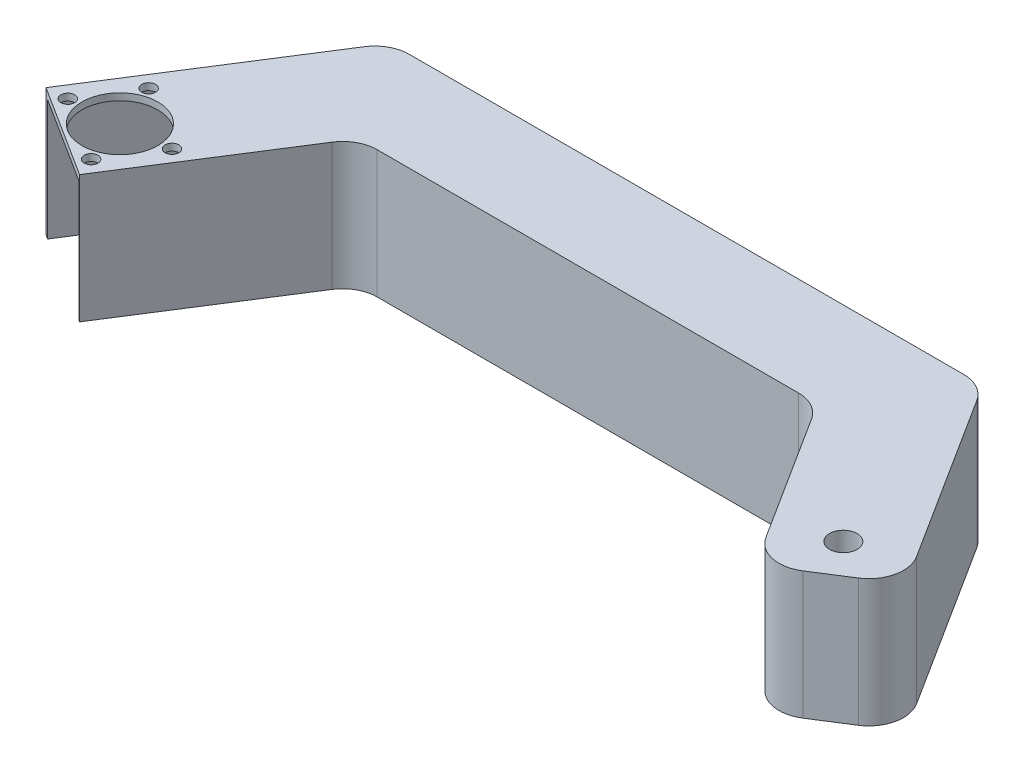
ISO-10303-21;
HEADER;
FILE_DESCRIPTION(('STEP AP214'),'2;1');
FILE_NAME('part.step','',(''),(''),'','','');
FILE_SCHEMA(('AUTOMOTIVE_DESIGN { 1 0 10303 214 1 1 1 1 }'));
ENDSEC;
DATA;
#1=APPLICATION_CONTEXT('core data for automotive mechanical design processes');
#2=APPLICATION_PROTOCOL_DEFINITION('international standard','automotive_design',2000,#1);
#3=PRODUCT_CONTEXT('',#1,'mechanical');
#4=PRODUCT('Part','Part','',(#3));
#5=PRODUCT_RELATED_PRODUCT_CATEGORY('part','',(#4));
#6=PRODUCT_DEFINITION_FORMATION('','',#4);
#7=PRODUCT_DEFINITION_CONTEXT('part definition',#1,'design');
#8=PRODUCT_DEFINITION('design','',#6,#7);
#9=PRODUCT_DEFINITION_SHAPE('','',#8);
#10=(LENGTH_UNIT() NAMED_UNIT(*) SI_UNIT(.MILLI.,.METRE.));
#11=(NAMED_UNIT(*) PLANE_ANGLE_UNIT() SI_UNIT($,.RADIAN.));
#12=(NAMED_UNIT(*) SI_UNIT($,.STERADIAN.) SOLID_ANGLE_UNIT());
#13=UNCERTAINTY_MEASURE_WITH_UNIT(LENGTH_MEASURE(1.E-05),#10,'distance_accuracy_value','');
#14=(GEOMETRIC_REPRESENTATION_CONTEXT(3) GLOBAL_UNCERTAINTY_ASSIGNED_CONTEXT((#13)) GLOBAL_UNIT_ASSIGNED_CONTEXT((#10,
#11,#12)) REPRESENTATION_CONTEXT('',''));
#15=CARTESIAN_POINT('',(0.,0.,0.));
#16=DIRECTION('',(0.,0.,1.));
#17=DIRECTION('',(1.,0.,0.));
#18=AXIS2_PLACEMENT_3D('',#15,#16,#17);
#19=CARTESIAN_POINT('',(45.3447070196285,-55.,18.3099547674291));
#20=DIRECTION('',(0.,1.,0.));
#21=DIRECTION('',(0.,0.,1.));
#22=AXIS2_PLACEMENT_3D('',#19,#20,#21);
#23=CYLINDRICAL_SURFACE('',#22,11.);
#24=CARTESIAN_POINT('',(45.3447070196285,37.,18.3099547674291));
#25=DIRECTION('',(0.,1.,0.));
#26=DIRECTION('',(0.,0.,1.));
#27=AXIS2_PLACEMENT_3D('',#24,#25,#26);
#28=CIRCLE('',#27,11.);
#29=CARTESIAN_POINT('',(45.3447070196285,37.,29.3099547674291));
#30=VERTEX_POINT('',#29);
#31=EDGE_CURVE('E243',#30,#30,#28,.T.);
#32=ORIENTED_EDGE('',*,*,#31,.T.);
#33=EDGE_LOOP('',(#32));
#34=FACE_BOUND('',#33,.T.);
#35=CARTESIAN_POINT('',(45.3447070196285,35.,18.3099547674291));
#36=DIRECTION('',(0.,-1.,0.));
#37=DIRECTION('',(0.,0.,-1.));
#38=AXIS2_PLACEMENT_3D('',#35,#36,#37);
#39=CIRCLE('',#38,11.);
#40=CARTESIAN_POINT('',(45.3447070196285,35.,7.30995476742916));
#41=VERTEX_POINT('',#40);
#42=EDGE_CURVE('E388',#41,#41,#39,.F.);
#43=ORIENTED_EDGE('',*,*,#42,.F.);
#44=EDGE_LOOP('',(#43));
#45=FACE_BOUND('',#44,.T.);
#46=ADVANCED_FACE('F37',(#34,#45),#23,.F.);
#47=CARTESIAN_POINT('',(59.1877599111612,-55.,17.0372070932107));
#48=DIRECTION('',(0.,1.,0.));
#49=DIRECTION('',(0.,0.,1.));
#50=AXIS2_PLACEMENT_3D('',#47,#48,#49);
#51=CYLINDRICAL_SURFACE('',#50,2.);
#52=CARTESIAN_POINT('',(59.1877599111612,37.,17.0372070932107));
#53=DIRECTION('',(0.,1.,0.));
#54=DIRECTION('',(0.,0.,-1.));
#55=AXIS2_PLACEMENT_3D('',#52,#53,#54);
#56=CIRCLE('',#55,2.);
#57=CARTESIAN_POINT('',(59.1877599111612,37.,15.0372070932107));
#58=VERTEX_POINT('',#57);
#59=EDGE_CURVE('E398',#58,#58,#56,.T.);
#60=ORIENTED_EDGE('',*,*,#59,.T.);
#61=EDGE_LOOP('',(#60));
#62=FACE_BOUND('',#61,.T.);
#63=CARTESIAN_POINT('',(59.1877599111612,35.,17.0372070932107));
#64=DIRECTION('',(0.,-1.,0.));
#65=DIRECTION('',(0.,0.,-1.));
#66=AXIS2_PLACEMENT_3D('',#63,#64,#65);
#67=CIRCLE('',#66,2.);
#68=CARTESIAN_POINT('',(59.1877599111612,35.,15.0372070932107));
#69=VERTEX_POINT('',#68);
#70=EDGE_CURVE('E385',#69,#69,#67,.F.);
#71=ORIENTED_EDGE('',*,*,#70,.F.);
#72=EDGE_LOOP('',(#71));
#73=FACE_BOUND('',#72,.T.);
#74=ADVANCED_FACE('F415',(#62,#73),#51,.F.);
#75=CARTESIAN_POINT('',(40.6210193428313,-55.,5.23567563884718));
#76=DIRECTION('',(0.,1.,0.));
#77=DIRECTION('',(0.,0.,1.));
#78=AXIS2_PLACEMENT_3D('',#75,#76,#77);
#79=CYLINDRICAL_SURFACE('',#78,2.);
#80=CARTESIAN_POINT('',(40.6210193428313,37.,5.23567563884718));
#81=DIRECTION('',(0.,1.,0.));
#82=DIRECTION('',(0.,0.,-1.));
#83=AXIS2_PLACEMENT_3D('',#80,#81,#82);
#84=CIRCLE('',#83,2.);
#85=CARTESIAN_POINT('',(40.6210193428313,37.,3.23567563884718));
#86=VERTEX_POINT('',#85);
#87=EDGE_CURVE('E395',#86,#86,#84,.T.);
#88=ORIENTED_EDGE('',*,*,#87,.T.);
#89=EDGE_LOOP('',(#88));
#90=FACE_BOUND('',#89,.T.);
#91=CARTESIAN_POINT('',(40.6210193428313,35.,5.23567563884718));
#92=DIRECTION('',(0.,-1.,0.));
#93=DIRECTION('',(0.,0.,-1.));
#94=AXIS2_PLACEMENT_3D('',#91,#92,#93);
#95=CIRCLE('',#94,2.);
#96=CARTESIAN_POINT('',(40.6210193428313,35.,3.23567563884718));
#97=VERTEX_POINT('',#96);
#98=EDGE_CURVE('E382',#97,#97,#95,.F.);
#99=ORIENTED_EDGE('',*,*,#98,.F.);
#100=EDGE_LOOP('',(#99));
#101=FACE_BOUND('',#100,.T.);
#102=ADVANCED_FACE('F418',(#90,#101),#79,.F.);
#103=CARTESIAN_POINT('',(50.0683946964257,-55.,31.3842338960111));
#104=DIRECTION('',(0.,1.,0.));
#105=DIRECTION('',(0.,0.,1.));
#106=AXIS2_PLACEMENT_3D('',#103,#104,#105);
#107=CYLINDRICAL_SURFACE('',#106,2.);
#108=CARTESIAN_POINT('',(50.0683946964257,37.,31.3842338960111));
#109=DIRECTION('',(0.,1.,0.));
#110=DIRECTION('',(0.,0.,1.));
#111=AXIS2_PLACEMENT_3D('',#108,#109,#110);
#112=CIRCLE('',#111,2.);
#113=CARTESIAN_POINT('',(50.0683946964257,37.,33.3842338960111));
#114=VERTEX_POINT('',#113);
#115=EDGE_CURVE('E247',#114,#114,#112,.T.);
#116=ORIENTED_EDGE('',*,*,#115,.T.);
#117=EDGE_LOOP('',(#116));
#118=FACE_BOUND('',#117,.T.);
#119=CARTESIAN_POINT('',(50.0683946964257,35.,31.3842338960111));
#120=DIRECTION('',(0.,-1.,0.));
#121=DIRECTION('',(0.,0.,-1.));
#122=AXIS2_PLACEMENT_3D('',#119,#120,#121);
#123=CIRCLE('',#122,2.);
#124=CARTESIAN_POINT('',(50.0683946964257,35.,29.3842338960111));
#125=VERTEX_POINT('',#124);
#126=EDGE_CURVE('E379',#125,#125,#123,.F.);
#127=ORIENTED_EDGE('',*,*,#126,.F.);
#128=EDGE_LOOP('',(#127));
#129=FACE_BOUND('',#128,.T.);
#130=ADVANCED_FACE('F435',(#118,#129),#107,.F.);
#131=CARTESIAN_POINT('',(31.5016541280958,-55.,19.5827024416476));
#132=DIRECTION('',(0.,1.,0.));
#133=DIRECTION('',(0.,0.,1.));
#134=AXIS2_PLACEMENT_3D('',#131,#132,#133);
#135=CYLINDRICAL_SURFACE('',#134,2.);
#136=CARTESIAN_POINT('',(31.5016541280958,37.,19.5827024416476));
#137=DIRECTION('',(0.,1.,0.));
#138=DIRECTION('',(0.,0.,1.));
#139=AXIS2_PLACEMENT_3D('',#136,#137,#138);
#140=CIRCLE('',#139,2.);
#141=CARTESIAN_POINT('',(31.5016541280958,37.,21.5827024416476));
#142=VERTEX_POINT('',#141);
#143=EDGE_CURVE('E256',#142,#142,#140,.T.);
#144=ORIENTED_EDGE('',*,*,#143,.T.);
#145=EDGE_LOOP('',(#144));
#146=FACE_BOUND('',#145,.T.);
#147=CARTESIAN_POINT('',(31.5016541280958,35.,19.5827024416476));
#148=DIRECTION('',(0.,-1.,0.));
#149=DIRECTION('',(0.,0.,-1.));
#150=AXIS2_PLACEMENT_3D('',#147,#148,#149);
#151=CIRCLE('',#150,2.);
#152=CARTESIAN_POINT('',(31.5016541280958,35.,17.5827024416476));
#153=VERTEX_POINT('',#152);
#154=EDGE_CURVE('E41',#153,#153,#151,.F.);
#155=ORIENTED_EDGE('',*,*,#154,.F.);
#156=EDGE_LOOP('',(#155));
#157=FACE_BOUND('',#156,.T.);
#158=ADVANCED_FACE('F433',(#146,#157),#135,.F.);
#159=CARTESIAN_POINT('',(69.8496368900044,37.,-31.1073872598005));
#160=DIRECTION('',(0.,-1.,0.));
#161=DIRECTION('',(0.,0.,-1.));
#162=AXIS2_PLACEMENT_3D('',#159,#160,#161);
#163=CYLINDRICAL_SURFACE('',#162,10.);
#164=CARTESIAN_POINT('',(69.8496368900044,0.,-31.1073872598005));
#165=DIRECTION('',(0.,1.,0.));
#166=DIRECTION('',(0.,0.,1.));
#167=AXIS2_PLACEMENT_3D('',#164,#165,#166);
#168=CIRCLE('',#167,10.);
#169=CARTESIAN_POINT('',(69.8496368900044,0.,-41.1073872598005));
#170=VERTEX_POINT('',#169);
#171=CARTESIAN_POINT('',(61.4102093589454,0.,-36.4717197390567));
#172=VERTEX_POINT('',#171);
#173=EDGE_CURVE('E183',#170,#172,#168,.T.);
#174=ORIENTED_EDGE('',*,*,#173,.T.);
#175=DIRECTION('',(0.,-1.,0.));
#176=VECTOR('',#175,1.);
#177=CARTESIAN_POINT('',(61.4102093589454,37.,-36.4717197390567));
#178=LINE('',#177,#176);
#179=CARTESIAN_POINT('',(61.4102093589454,37.,-36.4717197390567));
#180=VERTEX_POINT('',#179);
#181=EDGE_CURVE('E11',#180,#172,#178,.T.);
#182=ORIENTED_EDGE('',*,*,#181,.F.);
#183=CARTESIAN_POINT('',(69.8496368900044,37.,-31.1073872598005));
#184=DIRECTION('',(0.,1.,0.));
#185=DIRECTION('',(0.,0.,1.));
#186=AXIS2_PLACEMENT_3D('',#183,#184,#185);
#187=CIRCLE('',#186,10.);
#188=CARTESIAN_POINT('',(69.8496368900044,37.,-41.1073872598005));
#189=VERTEX_POINT('',#188);
#190=EDGE_CURVE('E213',#189,#180,#187,.T.);
#191=ORIENTED_EDGE('',*,*,#190,.F.);
#192=DIRECTION('',(0.,-1.,0.));
#193=VECTOR('',#192,1.);
#194=CARTESIAN_POINT('',(69.8496368900044,37.,-41.1073872598005));
#195=LINE('',#194,#193);
#196=EDGE_CURVE('E179',#189,#170,#195,.T.);
#197=ORIENTED_EDGE('',*,*,#196,.T.);
#198=EDGE_LOOP('',(#174,#182,#191,#197));
#199=FACE_BOUND('',#198,.T.);
#200=ADVANCED_FACE('F39',(#199),#163,.T.);
#201=CARTESIAN_POINT('',(25.5492890402526,37.,19.9464160489504));
#202=DIRECTION('',(0.843942753105905,0.,0.536433247925616));
#203=DIRECTION('',(0.536433247925616,0.,-0.843942753105905));
#204=AXIS2_PLACEMENT_3D('',#201,#202,#203);
#205=PLANE('',#204);
#206=DIRECTION('',(-0.536433247925616,0.,0.843942753105905));
#207=VECTOR('',#206,1.);
#208=CARTESIAN_POINT('',(25.5492890402526,0.,19.9464160489504));
#209=LINE('',#208,#207);
#210=CARTESIAN_POINT('',(25.5492890402526,0.,19.9464160489504));
#211=VERTEX_POINT('',#210);
#212=EDGE_CURVE('E186',#172,#211,#209,.T.);
#213=ORIENTED_EDGE('',*,*,#212,.T.);
#214=DIRECTION('',(0.,-1.,0.));
#215=VECTOR('',#214,1.);
#216=CARTESIAN_POINT('',(25.5492890402526,37.,19.9464160489504));
#217=LINE('',#216,#215);
#218=CARTESIAN_POINT('',(25.5492890402526,37.,19.9464160489504));
#219=VERTEX_POINT('',#218);
#220=EDGE_CURVE('E46',#219,#211,#217,.T.);
#221=ORIENTED_EDGE('',*,*,#220,.F.);
#222=DIRECTION('',(-0.536433247925616,0.,0.843942753105905));
#223=VECTOR('',#222,1.);
#224=CARTESIAN_POINT('',(30.9136215195088,37.,11.5069885178913));
#225=LINE('',#224,#223);
#226=EDGE_CURVE('E122',#180,#219,#225,.T.);
#227=ORIENTED_EDGE('',*,*,#226,.F.);
#228=ORIENTED_EDGE('',*,*,#181,.T.);
#229=EDGE_LOOP('',(#213,#221,#227,#228));
#230=FACE_BOUND('',#229,.T.);
#231=ADVANCED_FACE('F295',(#230),#205,.F.);
#232=CARTESIAN_POINT('',(52.2657270487895,37.,36.9281195604496));
#233=DIRECTION('',(0.536433247925616,0.,-0.843942753105905));
#234=DIRECTION('',(-0.843942753105905,0.,-0.536433247925616));
#235=AXIS2_PLACEMENT_3D('',#232,#233,#234);
#236=PLANE('',#235);
#237=DIRECTION('',(-0.843942753105905,0.,-0.536433247925616));
#238=VECTOR('',#237,1.);
#239=CARTESIAN_POINT('',(52.2657270487895,35.,36.9281195604496));
#240=LINE('',#239,#238);
#241=CARTESIAN_POINT('',(51.749431594295,35.,36.5999479557709));
#242=VERTEX_POINT('',#241);
#243=CARTESIAN_POINT('',(26.8140358286757,35.,20.750323926612));
#244=VERTEX_POINT('',#243);
#245=EDGE_CURVE('E359',#242,#244,#240,.T.);
#246=ORIENTED_EDGE('',*,*,#245,.F.);
#247=DIRECTION('',(0.,-1.,0.));
#248=VECTOR('',#247,1.);
#249=CARTESIAN_POINT('',(51.749431594295,37.,36.5999479557709));
#250=LINE('',#249,#248);
#251=CARTESIAN_POINT('',(51.749431594295,0.,36.5999479557709));
#252=VERTEX_POINT('',#251);
#253=EDGE_CURVE('E393',#242,#252,#250,.T.);
#254=ORIENTED_EDGE('',*,*,#253,.T.);
#255=DIRECTION('',(0.843942753105905,0.,0.536433247925616));
#256=VECTOR('',#255,1.);
#257=CARTESIAN_POINT('',(52.2657270487895,0.,36.9281195604496));
#258=LINE('',#257,#256);
#259=CARTESIAN_POINT('',(52.2657270487895,0.,36.9281195604496));
#260=VERTEX_POINT('',#259);
#261=EDGE_CURVE('E189',#252,#260,#258,.T.);
#262=ORIENTED_EDGE('',*,*,#261,.T.);
#263=DIRECTION('',(0.,-1.,0.));
#264=VECTOR('',#263,1.);
#265=CARTESIAN_POINT('',(52.2657270487895,37.,36.9281195604496));
#266=LINE('',#265,#264);
#267=CARTESIAN_POINT('',(52.2657270487895,37.,36.9281195604496));
#268=VERTEX_POINT('',#267);
#269=EDGE_CURVE('E238',#268,#260,#266,.T.);
#270=ORIENTED_EDGE('',*,*,#269,.F.);
#271=DIRECTION('',(0.843942753105905,0.,0.536433247925616));
#272=VECTOR('',#271,1.);
#273=CARTESIAN_POINT('',(52.2657270487895,37.,36.9281195604496));
#274=LINE('',#273,#272);
#275=EDGE_CURVE('E260',#219,#268,#274,.T.);
#276=ORIENTED_EDGE('',*,*,#275,.F.);
#277=ORIENTED_EDGE('',*,*,#220,.T.);
#278=CARTESIAN_POINT('',(26.8140358286757,0.,20.750323926612));
#279=VERTEX_POINT('',#278);
#280=EDGE_CURVE('E190',#211,#279,#258,.T.);
#281=ORIENTED_EDGE('',*,*,#280,.T.);
#282=DIRECTION('',(0.,1.,0.));
#283=VECTOR('',#282,1.);
#284=CARTESIAN_POINT('',(26.8140358286757,37.,20.750323926612));
#285=LINE('',#284,#283);
#286=EDGE_CURVE('E54',#279,#244,#285,.T.);
#287=ORIENTED_EDGE('',*,*,#286,.T.);
#288=EDGE_LOOP('',(#246,#254,#262,#270,#276,#277,#281,#287));
#289=FACE_BOUND('',#288,.T.);
#290=ADVANCED_FACE('F299',(#289),#236,.F.);
#291=CARTESIAN_POINT('',(80.7313683807615,37.,-7.85540533762101));
#292=DIRECTION('',(-0.843942753105905,0.,-0.536433247925616));
#293=DIRECTION('',(-0.536433247925616,0.,0.843942753105905));
#294=AXIS2_PLACEMENT_3D('',#291,#292,#293);
#295=PLANE('',#294);
#296=DIRECTION('',(0.536433247925616,0.,-0.843942753105905));
#297=VECTOR('',#296,1.);
#298=CARTESIAN_POINT('',(80.7313683807615,0.,-7.85540533762101));
#299=LINE('',#298,#297);
#300=CARTESIAN_POINT('',(80.7313683807615,0.,-7.85540533762101));
#301=VERTEX_POINT('',#300);
#302=EDGE_CURVE('E193',#260,#301,#299,.T.);
#303=ORIENTED_EDGE('',*,*,#302,.T.);
#304=DIRECTION('',(0.,-1.,0.));
#305=VECTOR('',#304,1.);
#306=CARTESIAN_POINT('',(80.7313683807615,37.,-7.85540533762101));
#307=LINE('',#306,#305);
#308=CARTESIAN_POINT('',(80.7313683807615,37.,-7.85540533762101));
#309=VERTEX_POINT('',#308);
#310=EDGE_CURVE('E235',#309,#301,#307,.T.);
#311=ORIENTED_EDGE('',*,*,#310,.F.);
#312=DIRECTION('',(0.536433247925616,0.,-0.843942753105905));
#313=VECTOR('',#312,1.);
#314=CARTESIAN_POINT('',(57.6300595280457,37.,28.4886920293905));
#315=LINE('',#314,#313);
#316=EDGE_CURVE('E262',#268,#309,#315,.T.);
#317=ORIENTED_EDGE('',*,*,#316,.F.);
#318=ORIENTED_EDGE('',*,*,#269,.T.);
#319=EDGE_LOOP('',(#303,#311,#317,#318));
#320=FACE_BOUND('',#319,.T.);
#321=ADVANCED_FACE('F305',(#320),#295,.F.);
#322=CARTESIAN_POINT('',(89.1707959118206,37.,-2.49107285836488));
#323=DIRECTION('',(0.,-1.,0.));
#324=DIRECTION('',(0.,0.,-1.));
#325=AXIS2_PLACEMENT_3D('',#322,#323,#324);
#326=CYLINDRICAL_SURFACE('',#325,10.);
#327=CARTESIAN_POINT('',(89.1707959118206,0.,-2.49107285836488));
#328=DIRECTION('',(0.,-1.,0.));
#329=DIRECTION('',(0.,0.,1.));
#330=AXIS2_PLACEMENT_3D('',#327,#328,#329);
#331=CIRCLE('',#330,10.);
#332=CARTESIAN_POINT('',(89.1707959118207,0.,-12.4910728583649));
#333=VERTEX_POINT('',#332);
#334=EDGE_CURVE('E195',#301,#333,#331,.T.);
#335=ORIENTED_EDGE('',*,*,#334,.T.);
#336=DIRECTION('',(0.,-1.,0.));
#337=VECTOR('',#336,1.);
#338=CARTESIAN_POINT('',(89.1707959118207,37.,-12.4910728583649));
#339=LINE('',#338,#337);
#340=CARTESIAN_POINT('',(89.1707959118207,37.,-12.4910728583649));
#341=VERTEX_POINT('',#340);
#342=EDGE_CURVE('E232',#341,#333,#339,.T.);
#343=ORIENTED_EDGE('',*,*,#342,.F.);
#344=CARTESIAN_POINT('',(89.1707959118206,37.,-2.49107285836488));
#345=DIRECTION('',(0.,-1.,0.));
#346=DIRECTION('',(0.,0.,1.));
#347=AXIS2_PLACEMENT_3D('',#344,#345,#346);
#348=CIRCLE('',#347,10.);
#349=EDGE_CURVE('E264',#309,#341,#348,.T.);
#350=ORIENTED_EDGE('',*,*,#349,.F.);
#351=ORIENTED_EDGE('',*,*,#310,.T.);
#352=EDGE_LOOP('',(#335,#343,#350,#351));
#353=FACE_BOUND('',#352,.T.);
#354=ADVANCED_FACE('F311',(#353),#326,.F.);
#355=CARTESIAN_POINT('',(89.1707959118207,37.,-12.4910728583649));
#356=DIRECTION('',(0.,0.,-1.));
#357=DIRECTION('',(-1.,0.,0.));
#358=AXIS2_PLACEMENT_3D('',#355,#356,#357);
#359=PLANE('',#358);
#360=DIRECTION('',(1.,0.,0.));
#361=VECTOR('',#360,1.);
#362=CARTESIAN_POINT('',(89.1707959118207,0.,-12.4910728583649));
#363=LINE('',#362,#361);
#364=CARTESIAN_POINT('',(211.363090572033,0.,-12.4910728583649));
#365=VERTEX_POINT('',#364);
#366=EDGE_CURVE('E197',#333,#365,#363,.T.);
#367=ORIENTED_EDGE('',*,*,#366,.T.);
#368=DIRECTION('',(0.,-1.,0.));
#369=VECTOR('',#368,1.);
#370=CARTESIAN_POINT('',(211.363090572033,37.,-12.4910728583649));
#371=LINE('',#370,#369);
#372=CARTESIAN_POINT('',(211.363090572033,37.,-12.4910728583649));
#373=VERTEX_POINT('',#372);
#374=EDGE_CURVE('E229',#373,#365,#371,.T.);
#375=ORIENTED_EDGE('',*,*,#374,.F.);
#376=DIRECTION('',(1.,0.,0.));
#377=VECTOR('',#376,1.);
#378=CARTESIAN_POINT('',(89.1707959118207,37.,-12.4910728583649));
#379=LINE('',#378,#377);
#380=EDGE_CURVE('E266',#341,#373,#379,.T.);
#381=ORIENTED_EDGE('',*,*,#380,.F.);
#382=ORIENTED_EDGE('',*,*,#342,.T.);
#383=EDGE_LOOP('',(#367,#375,#381,#382));
#384=FACE_BOUND('',#383,.T.);
#385=ADVANCED_FACE('F315',(#384),#359,.F.);
#386=CARTESIAN_POINT('',(211.363090572033,37.,-2.49107285836488));
#387=DIRECTION('',(0.,-1.,0.));
#388=DIRECTION('',(0.,0.,-1.));
#389=AXIS2_PLACEMENT_3D('',#386,#387,#388);
#390=CYLINDRICAL_SURFACE('',#389,9.99999999999999);
#391=CARTESIAN_POINT('',(211.363090572033,0.,-2.49107285836488));
#392=DIRECTION('',(0.,-1.,0.));
#393=DIRECTION('',(0.,0.,-1.));
#394=AXIS2_PLACEMENT_3D('',#391,#392,#393);
#395=CIRCLE('',#394,9.99999999999999);
#396=CARTESIAN_POINT('',(219.802518103092,0.,-7.85540533762101));
#397=VERTEX_POINT('',#396);
#398=EDGE_CURVE('E199',#365,#397,#395,.T.);
#399=ORIENTED_EDGE('',*,*,#398,.T.);
#400=DIRECTION('',(0.,-1.,0.));
#401=VECTOR('',#400,1.);
#402=CARTESIAN_POINT('',(219.802518103092,37.,-7.85540533762101));
#403=LINE('',#402,#401);
#404=CARTESIAN_POINT('',(219.802518103092,37.,-7.85540533762101));
#405=VERTEX_POINT('',#404);
#406=EDGE_CURVE('E226',#405,#397,#403,.T.);
#407=ORIENTED_EDGE('',*,*,#406,.F.);
#408=CARTESIAN_POINT('',(211.363090572033,37.,-2.49107285836488));
#409=DIRECTION('',(0.,-1.,0.));
#410=DIRECTION('',(0.,0.,-1.));
#411=AXIS2_PLACEMENT_3D('',#408,#409,#410);
#412=CIRCLE('',#411,9.99999999999999);
#413=EDGE_CURVE('E268',#373,#405,#412,.T.);
#414=ORIENTED_EDGE('',*,*,#413,.F.);
#415=ORIENTED_EDGE('',*,*,#374,.T.);
#416=EDGE_LOOP('',(#399,#407,#414,#415));
#417=FACE_BOUND('',#416,.T.);
#418=ADVANCED_FACE('F320',(#417),#390,.F.);
#419=CARTESIAN_POINT('',(219.802518103092,37.,-7.85540533762101));
#420=DIRECTION('',(0.843942753105905,0.,-0.536433247925616));
#421=DIRECTION('',(-0.536433247925616,0.,-0.843942753105905));
#422=AXIS2_PLACEMENT_3D('',#419,#420,#421);
#423=PLANE('',#422);
#424=DIRECTION('',(0.536433247925616,0.,0.843942753105905));
#425=VECTOR('',#424,1.);
#426=CARTESIAN_POINT('',(219.802518103092,0.,-7.85540533762101));
#427=LINE('',#426,#425);
#428=CARTESIAN_POINT('',(242.903826955808,0.,28.4886920293905));
#429=VERTEX_POINT('',#428);
#430=EDGE_CURVE('E201',#397,#429,#427,.T.);
#431=ORIENTED_EDGE('',*,*,#430,.T.);
#432=DIRECTION('',(0.,-1.,0.));
#433=VECTOR('',#432,1.);
#434=CARTESIAN_POINT('',(242.903826955808,37.,28.4886920293905));
#435=LINE('',#434,#433);
#436=CARTESIAN_POINT('',(242.903826955808,37.,28.4886920293905));
#437=VERTEX_POINT('',#436);
#438=EDGE_CURVE('E223',#437,#429,#435,.T.);
#439=ORIENTED_EDGE('',*,*,#438,.F.);
#440=DIRECTION('',(0.536433247925616,0.,0.843942753105905));
#441=VECTOR('',#440,1.);
#442=CARTESIAN_POINT('',(219.802518103092,37.,-7.85540533762101));
#443=LINE('',#442,#441);
#444=EDGE_CURVE('E270',#405,#437,#443,.T.);
#445=ORIENTED_EDGE('',*,*,#444,.F.);
#446=ORIENTED_EDGE('',*,*,#406,.T.);
#447=EDGE_LOOP('',(#431,#439,#445,#446));
#448=FACE_BOUND('',#447,.T.);
#449=ADVANCED_FACE('F324',(#448),#423,.F.);
#450=CARTESIAN_POINT('',(251.343254486867,37.,23.1243595501344));
#451=DIRECTION('',(0.,-1.,0.));
#452=DIRECTION('',(0.,0.,-1.));
#453=AXIS2_PLACEMENT_3D('',#450,#451,#452);
#454=CYLINDRICAL_SURFACE('',#453,10.);
#455=CARTESIAN_POINT('',(251.343254486867,0.,23.1243595501344));
#456=DIRECTION('',(0.,1.,0.));
#457=DIRECTION('',(0.,0.,-1.));
#458=AXIS2_PLACEMENT_3D('',#455,#456,#457);
#459=CIRCLE('',#458,10.);
#460=CARTESIAN_POINT('',(256.707586966124,0.,31.5637870811934));
#461=VERTEX_POINT('',#460);
#462=EDGE_CURVE('E203',#429,#461,#459,.T.);
#463=ORIENTED_EDGE('',*,*,#462,.T.);
#464=DIRECTION('',(0.,-1.,0.));
#465=VECTOR('',#464,1.);
#466=CARTESIAN_POINT('',(256.707586966124,37.,31.5637870811934));
#467=LINE('',#466,#465);
#468=CARTESIAN_POINT('',(256.707586966124,37.,31.5637870811934));
#469=VERTEX_POINT('',#468);
#470=EDGE_CURVE('E220',#469,#461,#467,.T.);
#471=ORIENTED_EDGE('',*,*,#470,.F.);
#472=CARTESIAN_POINT('',(251.343254486867,37.,23.1243595501344));
#473=DIRECTION('',(0.,1.,0.));
#474=DIRECTION('',(0.,0.,-1.));
#475=AXIS2_PLACEMENT_3D('',#472,#473,#474);
#476=CIRCLE('',#475,10.);
#477=EDGE_CURVE('E272',#437,#469,#476,.T.);
#478=ORIENTED_EDGE('',*,*,#477,.F.);
#479=ORIENTED_EDGE('',*,*,#438,.T.);
#480=EDGE_LOOP('',(#463,#471,#478,#479));
#481=FACE_BOUND('',#480,.T.);
#482=ADVANCED_FACE('F328',(#481),#454,.T.);
#483=CARTESIAN_POINT('',(256.707586966124,37.,31.5637870811934));
#484=DIRECTION('',(-0.536433247925616,0.,-0.843942753105905));
#485=DIRECTION('',(-0.843942753105905,0.,0.536433247925616));
#486=AXIS2_PLACEMENT_3D('',#483,#484,#485);
#487=PLANE('',#486);
#488=DIRECTION('',(0.843942753105905,0.,-0.536433247925616));
#489=VECTOR('',#488,1.);
#490=CARTESIAN_POINT('',(256.707586966124,0.,31.5637870811934));
#491=LINE('',#490,#489);
#492=CARTESIAN_POINT('',(266.545169912542,0.,25.3107485282066));
#493=VERTEX_POINT('',#492);
#494=EDGE_CURVE('E205',#461,#493,#491,.T.);
#495=ORIENTED_EDGE('',*,*,#494,.T.);
#496=DIRECTION('',(0.,-1.,0.));
#497=VECTOR('',#496,1.);
#498=CARTESIAN_POINT('',(266.545169912542,37.,25.3107485282066));
#499=LINE('',#498,#497);
#500=CARTESIAN_POINT('',(266.545169912542,37.,25.3107485282066));
#501=VERTEX_POINT('',#500);
#502=EDGE_CURVE('E217',#501,#493,#499,.T.);
#503=ORIENTED_EDGE('',*,*,#502,.F.);
#504=DIRECTION('',(0.843942753105905,0.,-0.536433247925616));
#505=VECTOR('',#504,1.);
#506=CARTESIAN_POINT('',(256.707586966124,37.,31.5637870811934));
#507=LINE('',#506,#505);
#508=EDGE_CURVE('E274',#469,#501,#507,.T.);
#509=ORIENTED_EDGE('',*,*,#508,.F.);
#510=ORIENTED_EDGE('',*,*,#470,.T.);
#511=EDGE_LOOP('',(#495,#503,#509,#510));
#512=FACE_BOUND('',#511,.T.);
#513=ADVANCED_FACE('F280',(#512),#487,.F.);
#514=CARTESIAN_POINT('',(261.180837433286,37.,16.8713209971475));
#515=DIRECTION('',(0.,-1.,0.));
#516=DIRECTION('',(0.,0.,-1.));
#517=AXIS2_PLACEMENT_3D('',#514,#515,#516);
#518=CYLINDRICAL_SURFACE('',#517,9.99999999999997);
#519=CARTESIAN_POINT('',(261.180837433286,0.,16.8713209971475));
#520=DIRECTION('',(0.,1.,0.));
#521=DIRECTION('',(0.,0.,-1.));
#522=AXIS2_PLACEMENT_3D('',#519,#520,#521);
#523=CIRCLE('',#522,9.99999999999997);
#524=CARTESIAN_POINT('',(269.620264964345,0.,11.5069885178913));
#525=VERTEX_POINT('',#524);
#526=EDGE_CURVE('E207',#493,#525,#523,.T.);
#527=ORIENTED_EDGE('',*,*,#526,.T.);
#528=DIRECTION('',(0.,-1.,0.));
#529=VECTOR('',#528,1.);
#530=CARTESIAN_POINT('',(269.620264964345,37.,11.5069885178913));
#531=LINE('',#530,#529);
#532=CARTESIAN_POINT('',(269.620264964345,37.,11.5069885178913));
#533=VERTEX_POINT('',#532);
#534=EDGE_CURVE('E174',#533,#525,#531,.T.);
#535=ORIENTED_EDGE('',*,*,#534,.F.);
#536=CARTESIAN_POINT('',(261.180837433286,37.,16.8713209971475));
#537=DIRECTION('',(0.,1.,0.));
#538=DIRECTION('',(0.,0.,-1.));
#539=AXIS2_PLACEMENT_3D('',#536,#537,#538);
#540=CIRCLE('',#539,9.99999999999997);
#541=EDGE_CURVE('E162',#501,#533,#540,.T.);
#542=ORIENTED_EDGE('',*,*,#541,.F.);
#543=ORIENTED_EDGE('',*,*,#502,.T.);
#544=EDGE_LOOP('',(#527,#535,#542,#543));
#545=FACE_BOUND('',#544,.T.);
#546=ADVANCED_FACE('F284',(#545),#518,.T.);
#547=CARTESIAN_POINT('',(269.620264964345,37.,11.5069885178913));
#548=DIRECTION('',(-0.843942753105905,0.,0.536433247925616));
#549=DIRECTION('',(0.536433247925616,0.,0.843942753105905));
#550=AXIS2_PLACEMENT_3D('',#547,#548,#549);
#551=PLANE('',#550);
#552=DIRECTION('',(-0.536433247925616,0.,-0.843942753105905));
#553=VECTOR('',#552,1.);
#554=CARTESIAN_POINT('',(269.620264964345,0.,11.5069885178913));
#555=LINE('',#554,#553);
#556=CARTESIAN_POINT('',(239.123677124909,0.,-36.4717197390567));
#557=VERTEX_POINT('',#556);
#558=EDGE_CURVE('E171',#525,#557,#555,.T.);
#559=ORIENTED_EDGE('',*,*,#558,.T.);
#560=DIRECTION('',(0.,-1.,0.));
#561=VECTOR('',#560,1.);
#562=CARTESIAN_POINT('',(239.123677124909,37.,-36.4717197390567));
#563=LINE('',#562,#561);
#564=CARTESIAN_POINT('',(239.123677124909,37.,-36.4717197390567));
#565=VERTEX_POINT('',#564);
#566=EDGE_CURVE('E168',#565,#557,#563,.T.);
#567=ORIENTED_EDGE('',*,*,#566,.F.);
#568=DIRECTION('',(-0.536433247925616,0.,-0.843942753105905));
#569=VECTOR('',#568,1.);
#570=CARTESIAN_POINT('',(269.620264964345,37.,11.5069885178913));
#571=LINE('',#570,#569);
#572=EDGE_CURVE('E155',#533,#565,#571,.T.);
#573=ORIENTED_EDGE('',*,*,#572,.F.);
#574=ORIENTED_EDGE('',*,*,#534,.T.);
#575=EDGE_LOOP('',(#559,#567,#573,#574));
#576=FACE_BOUND('',#575,.T.);
#577=ADVANCED_FACE('F169',(#576),#551,.F.);
#578=CARTESIAN_POINT('',(230.684249593849,37.,-31.1073872598005));
#579=DIRECTION('',(0.,-1.,0.));
#580=DIRECTION('',(0.,0.,-1.));
#581=AXIS2_PLACEMENT_3D('',#578,#579,#580);
#582=CYLINDRICAL_SURFACE('',#581,10.);
#583=CARTESIAN_POINT('',(230.684249593849,0.,-31.1073872598005));
#584=DIRECTION('',(0.,1.,0.));
#585=DIRECTION('',(0.,0.,-1.));
#586=AXIS2_PLACEMENT_3D('',#583,#584,#585);
#587=CIRCLE('',#586,10.);
#588=CARTESIAN_POINT('',(230.684249593849,0.,-41.1073872598005));
#589=VERTEX_POINT('',#588);
#590=EDGE_CURVE('E210',#557,#589,#587,.T.);
#591=ORIENTED_EDGE('',*,*,#590,.T.);
#592=DIRECTION('',(0.,-1.,0.));
#593=VECTOR('',#592,1.);
#594=CARTESIAN_POINT('',(230.684249593849,37.,-41.1073872598005));
#595=LINE('',#594,#593);
#596=CARTESIAN_POINT('',(230.684249593849,37.,-41.1073872598005));
#597=VERTEX_POINT('',#596);
#598=EDGE_CURVE('E175',#597,#589,#595,.T.);
#599=ORIENTED_EDGE('',*,*,#598,.F.);
#600=CARTESIAN_POINT('',(230.684249593849,37.,-31.1073872598005));
#601=DIRECTION('',(0.,1.,0.));
#602=DIRECTION('',(0.,0.,-1.));
#603=AXIS2_PLACEMENT_3D('',#600,#601,#602);
#604=CIRCLE('',#603,10.);
#605=EDGE_CURVE('E159',#565,#597,#604,.T.);
#606=ORIENTED_EDGE('',*,*,#605,.F.);
#607=ORIENTED_EDGE('',*,*,#566,.T.);
#608=EDGE_LOOP('',(#591,#599,#606,#607));
#609=FACE_BOUND('',#608,.T.);
#610=ADVANCED_FACE('F177',(#609),#582,.T.);
#611=CARTESIAN_POINT('',(69.8496368900044,37.,-41.1073872598005));
#612=DIRECTION('',(0.,0.,1.));
#613=DIRECTION('',(1.,0.,0.));
#614=AXIS2_PLACEMENT_3D('',#611,#612,#613);
#615=PLANE('',#614);
#616=DIRECTION('',(-1.,0.,0.));
#617=VECTOR('',#616,1.);
#618=CARTESIAN_POINT('',(69.8496368900044,0.,-41.1073872598005));
#619=LINE('',#618,#617);
#620=EDGE_CURVE('E114',#589,#170,#619,.T.);
#621=ORIENTED_EDGE('',*,*,#620,.T.);
#622=ORIENTED_EDGE('',*,*,#196,.F.);
#623=DIRECTION('',(-1.,0.,0.));
#624=VECTOR('',#623,1.);
#625=CARTESIAN_POINT('',(69.8496368900044,37.,-41.1073872598005));
#626=LINE('',#625,#624);
#627=EDGE_CURVE('E63',#597,#189,#626,.T.);
#628=ORIENTED_EDGE('',*,*,#627,.F.);
#629=ORIENTED_EDGE('',*,*,#598,.T.);
#630=EDGE_LOOP('',(#621,#622,#628,#629));
#631=FACE_BOUND('',#630,.T.);
#632=ADVANCED_FACE('F289',(#631),#615,.F.);
#633=CARTESIAN_POINT('',(69.8496368900044,37.,-31.1073872598005));
#634=DIRECTION('',(0.,1.,0.));
#635=DIRECTION('',(0.,0.,1.));
#636=AXIS2_PLACEMENT_3D('',#633,#634,#635);
#637=PLANE('',#636);
#638=ORIENTED_EDGE('',*,*,#143,.F.);
#639=EDGE_LOOP('',(#638));
#640=FACE_BOUND('',#639,.T.);
#641=ORIENTED_EDGE('',*,*,#115,.F.);
#642=EDGE_LOOP('',(#641));
#643=FACE_BOUND('',#642,.T.);
#644=CARTESIAN_POINT('',(255.189179464225,37.,18.3099547674291));
#645=DIRECTION('',(0.,1.,0.));
#646=DIRECTION('',(0.,0.,1.));
#647=AXIS2_PLACEMENT_3D('',#644,#645,#646);
#648=CIRCLE('',#647,3.99999999999999);
#649=CARTESIAN_POINT('',(255.189179464225,37.,22.3099547674291));
#650=VERTEX_POINT('',#649);
#651=EDGE_CURVE('E252',#650,#650,#648,.T.);
#652=ORIENTED_EDGE('',*,*,#651,.F.);
#653=EDGE_LOOP('',(#652));
#654=FACE_BOUND('',#653,.T.);
#655=ORIENTED_EDGE('',*,*,#87,.F.);
#656=EDGE_LOOP('',(#655));
#657=FACE_BOUND('',#656,.T.);
#658=ORIENTED_EDGE('',*,*,#59,.F.);
#659=EDGE_LOOP('',(#658));
#660=FACE_BOUND('',#659,.T.);
#661=ORIENTED_EDGE('',*,*,#31,.F.);
#662=EDGE_LOOP('',(#661));
#663=FACE_BOUND('',#662,.T.);
#664=ORIENTED_EDGE('',*,*,#190,.T.);
#665=ORIENTED_EDGE('',*,*,#226,.T.);
#666=ORIENTED_EDGE('',*,*,#275,.T.);
#667=ORIENTED_EDGE('',*,*,#316,.T.);
#668=ORIENTED_EDGE('',*,*,#349,.T.);
#669=ORIENTED_EDGE('',*,*,#380,.T.);
#670=ORIENTED_EDGE('',*,*,#413,.T.);
#671=ORIENTED_EDGE('',*,*,#444,.T.);
#672=ORIENTED_EDGE('',*,*,#477,.T.);
#673=ORIENTED_EDGE('',*,*,#508,.T.);
#674=ORIENTED_EDGE('',*,*,#541,.T.);
#675=ORIENTED_EDGE('',*,*,#572,.T.);
#676=ORIENTED_EDGE('',*,*,#605,.T.);
#677=ORIENTED_EDGE('',*,*,#627,.T.);
#678=EDGE_LOOP('',(#664,#665,#666,#667,#668,#669,#670,#671,#672,#673,#674,#675,#676,#677));
#679=FACE_BOUND('',#678,.T.);
#680=ADVANCED_FACE('F157',(#640,#643,#654,#657,#660,#663,#679),#637,.T.);
#681=CARTESIAN_POINT('',(69.8496368900044,0.,-31.1073872598005));
#682=DIRECTION('',(0.,1.,0.));
#683=DIRECTION('',(0.,0.,1.));
#684=AXIS2_PLACEMENT_3D('',#681,#682,#683);
#685=PLANE('',#684);
#686=CARTESIAN_POINT('',(255.189179464225,0.,18.3099547674291));
#687=DIRECTION('',(0.,1.,0.));
#688=DIRECTION('',(0.,0.,1.));
#689=AXIS2_PLACEMENT_3D('',#686,#687,#688);
#690=CIRCLE('',#689,3.99999999999999);
#691=CARTESIAN_POINT('',(255.189179464225,0.,22.3099547674291));
#692=VERTEX_POINT('',#691);
#693=EDGE_CURVE('E187',#692,#692,#690,.T.);
#694=ORIENTED_EDGE('',*,*,#693,.T.);
#695=EDGE_LOOP('',(#694));
#696=FACE_BOUND('',#695,.T.);
#697=ORIENTED_EDGE('',*,*,#261,.F.);
#698=DIRECTION('',(-0.506424966342512,0.,0.862284032940994));
#699=VECTOR('',#698,1.);
#700=CARTESIAN_POINT('',(78.9219679378906,0.,-9.66642076773432));
#701=LINE('',#700,#699);
#702=CARTESIAN_POINT('',(78.9219679378906,0.,-9.66642076773432));
#703=VERTEX_POINT('',#702);
#704=EDGE_CURVE('E334',#703,#252,#701,.T.);
#705=ORIENTED_EDGE('',*,*,#704,.F.);
#706=DIRECTION('',(0.858569654064467,0.,0.512696936912658));
#707=VECTOR('',#706,1.);
#708=CARTESIAN_POINT('',(55.1675009352684,0.,-23.8514579543884));
#709=LINE('',#708,#707);
#710=CARTESIAN_POINT('',(55.1675009352684,0.,-23.8514579543884));
#711=VERTEX_POINT('',#710);
#712=EDGE_CURVE('E375',#711,#703,#709,.T.);
#713=ORIENTED_EDGE('',*,*,#712,.F.);
#714=DIRECTION('',(0.536478320667977,0.,-0.843914101940042));
#715=VECTOR('',#714,1.);
#716=CARTESIAN_POINT('',(26.2486574049579,0.,21.6396997062595));
#717=LINE('',#716,#715);
#718=EDGE_CURVE('E364',#279,#711,#717,.T.);
#719=ORIENTED_EDGE('',*,*,#718,.F.);
#720=ORIENTED_EDGE('',*,*,#280,.F.);
#721=ORIENTED_EDGE('',*,*,#212,.F.);
#722=ORIENTED_EDGE('',*,*,#173,.F.);
#723=ORIENTED_EDGE('',*,*,#620,.F.);
#724=ORIENTED_EDGE('',*,*,#590,.F.);
#725=ORIENTED_EDGE('',*,*,#558,.F.);
#726=ORIENTED_EDGE('',*,*,#526,.F.);
#727=ORIENTED_EDGE('',*,*,#494,.F.);
#728=ORIENTED_EDGE('',*,*,#462,.F.);
#729=ORIENTED_EDGE('',*,*,#430,.F.);
#730=ORIENTED_EDGE('',*,*,#398,.F.);
#731=ORIENTED_EDGE('',*,*,#366,.F.);
#732=ORIENTED_EDGE('',*,*,#334,.F.);
#733=ORIENTED_EDGE('',*,*,#302,.F.);
#734=EDGE_LOOP('',(#697,#705,#713,#719,#720,#721,#722,#723,#724,#725,#726,#727,#728,#729,#730,
#731,#732,#733));
#735=FACE_BOUND('',#734,.T.);
#736=ADVANCED_FACE('F287',(#696,#735),#685,.F.);
#737=CARTESIAN_POINT('',(255.189179464225,-55.,18.3099547674291));
#738=DIRECTION('',(0.,1.,0.));
#739=DIRECTION('',(0.,0.,1.));
#740=AXIS2_PLACEMENT_3D('',#737,#738,#739);
#741=CYLINDRICAL_SURFACE('',#740,3.99999999999999);
#742=ORIENTED_EDGE('',*,*,#651,.T.);
#743=EDGE_LOOP('',(#742));
#744=FACE_BOUND('',#743,.T.);
#745=ORIENTED_EDGE('',*,*,#693,.F.);
#746=EDGE_LOOP('',(#745));
#747=FACE_BOUND('',#746,.T.);
#748=ADVANCED_FACE('F403',(#744,#747),#741,.F.);
#749=CARTESIAN_POINT('',(78.9219679378906,35.,-9.66642076773432));
#750=DIRECTION('',(0.862284032940994,0.,0.506424966342512));
#751=DIRECTION('',(0.506424966342512,0.,-0.862284032940994));
#752=AXIS2_PLACEMENT_3D('',#749,#750,#751);
#753=PLANE('',#752);
#754=DIRECTION('',(-0.506424966342512,0.,0.862284032940994));
#755=VECTOR('',#754,1.);
#756=CARTESIAN_POINT('',(78.9219679378906,35.,-9.66642076773432));
#757=LINE('',#756,#755);
#758=CARTESIAN_POINT('',(78.9219679378906,35.,-9.66642076773432));
#759=VERTEX_POINT('',#758);
#760=EDGE_CURVE('E368',#759,#242,#757,.T.);
#761=ORIENTED_EDGE('',*,*,#760,.F.);
#762=DIRECTION('',(0.,-1.,0.));
#763=VECTOR('',#762,1.);
#764=CARTESIAN_POINT('',(78.9219679378906,35.,-9.66642076773432));
#765=LINE('',#764,#763);
#766=EDGE_CURVE('E367',#759,#703,#765,.T.);
#767=ORIENTED_EDGE('',*,*,#766,.T.);
#768=ORIENTED_EDGE('',*,*,#704,.T.);
#769=ORIENTED_EDGE('',*,*,#253,.F.);
#770=EDGE_LOOP('',(#761,#767,#768,#769));
#771=FACE_BOUND('',#770,.T.);
#772=ADVANCED_FACE('F545',(#771),#753,.F.);
#773=CARTESIAN_POINT('',(26.2486574049579,35.,21.6396997062595));
#774=DIRECTION('',(-0.843914101940042,0.,-0.536478320667977));
#775=DIRECTION('',(-0.536478320667977,0.,0.843914101940042));
#776=AXIS2_PLACEMENT_3D('',#773,#774,#775);
#777=PLANE('',#776);
#778=ORIENTED_EDGE('',*,*,#718,.T.);
#779=DIRECTION('',(0.,-1.,0.));
#780=VECTOR('',#779,1.);
#781=CARTESIAN_POINT('',(55.1675009352684,35.,-23.8514579543884));
#782=LINE('',#781,#780);
#783=CARTESIAN_POINT('',(55.1675009352684,35.,-23.8514579543884));
#784=VERTEX_POINT('',#783);
#785=EDGE_CURVE('E362',#784,#711,#782,.T.);
#786=ORIENTED_EDGE('',*,*,#785,.F.);
#787=DIRECTION('',(0.536478320667977,0.,-0.843914101940042));
#788=VECTOR('',#787,1.);
#789=CARTESIAN_POINT('',(26.2486574049579,35.,21.6396997062595));
#790=LINE('',#789,#788);
#791=EDGE_CURVE('E352',#244,#784,#790,.T.);
#792=ORIENTED_EDGE('',*,*,#791,.F.);
#793=ORIENTED_EDGE('',*,*,#286,.F.);
#794=EDGE_LOOP('',(#778,#786,#792,#793));
#795=FACE_BOUND('',#794,.T.);
#796=ADVANCED_FACE('F363',(#795),#777,.F.);
#797=CARTESIAN_POINT('',(0.,35.,0.));
#798=DIRECTION('',(0.,-1.,0.));
#799=DIRECTION('',(0.,0.,-1.));
#800=AXIS2_PLACEMENT_3D('',#797,#798,#799);
#801=PLANE('',#800);
#802=ORIENTED_EDGE('',*,*,#42,.T.);
#803=EDGE_LOOP('',(#802));
#804=FACE_BOUND('',#803,.T.);
#805=ORIENTED_EDGE('',*,*,#70,.T.);
#806=EDGE_LOOP('',(#805));
#807=FACE_BOUND('',#806,.T.);
#808=ORIENTED_EDGE('',*,*,#98,.T.);
#809=EDGE_LOOP('',(#808));
#810=FACE_BOUND('',#809,.T.);
#811=ORIENTED_EDGE('',*,*,#126,.T.);
#812=EDGE_LOOP('',(#811));
#813=FACE_BOUND('',#812,.T.);
#814=ORIENTED_EDGE('',*,*,#154,.T.);
#815=EDGE_LOOP('',(#814));
#816=FACE_BOUND('',#815,.T.);
#817=ORIENTED_EDGE('',*,*,#245,.T.);
#818=ORIENTED_EDGE('',*,*,#791,.T.);
#819=DIRECTION('',(0.858569654064467,0.,0.512696936912658));
#820=VECTOR('',#819,1.);
#821=CARTESIAN_POINT('',(55.1675009352684,35.,-23.8514579543884));
#822=LINE('',#821,#820);
#823=EDGE_CURVE('E357',#784,#759,#822,.T.);
#824=ORIENTED_EDGE('',*,*,#823,.T.);
#825=ORIENTED_EDGE('',*,*,#760,.T.);
#826=EDGE_LOOP('',(#817,#818,#824,#825));
#827=FACE_BOUND('',#826,.T.);
#828=ADVANCED_FACE('F354',(#804,#807,#810,#813,#816,#827),#801,.T.);
#829=CARTESIAN_POINT('',(55.1675009352684,35.,-23.8514579543884));
#830=DIRECTION('',(0.512696936912658,0.,-0.858569654064467));
#831=DIRECTION('',(-0.858569654064467,0.,-0.512696936912658));
#832=AXIS2_PLACEMENT_3D('',#829,#830,#831);
#833=PLANE('',#832);
#834=ORIENTED_EDGE('',*,*,#712,.T.);
#835=ORIENTED_EDGE('',*,*,#766,.F.);
#836=ORIENTED_EDGE('',*,*,#823,.F.);
#837=ORIENTED_EDGE('',*,*,#785,.T.);
#838=EDGE_LOOP('',(#834,#835,#836,#837));
#839=FACE_BOUND('',#838,.T.);
#840=ADVANCED_FACE('F370',(#839),#833,.F.);
#841=CLOSED_SHELL('',(#46,#74,#102,#130,#158,#200,#231,#290,#321,#354,#385,#418,#449,#482,#513,
#546,#577,#610,#632,#680,#736,#748,#772,#796,#828,#840));
#842=MANIFOLD_SOLID_BREP('B2',#841);
#843=ADVANCED_BREP_SHAPE_REPRESENTATION('',(#18,#842),#14);
#844=SHAPE_DEFINITION_REPRESENTATION(#9,#843);
ENDSEC;
END-ISO-10303-21;
